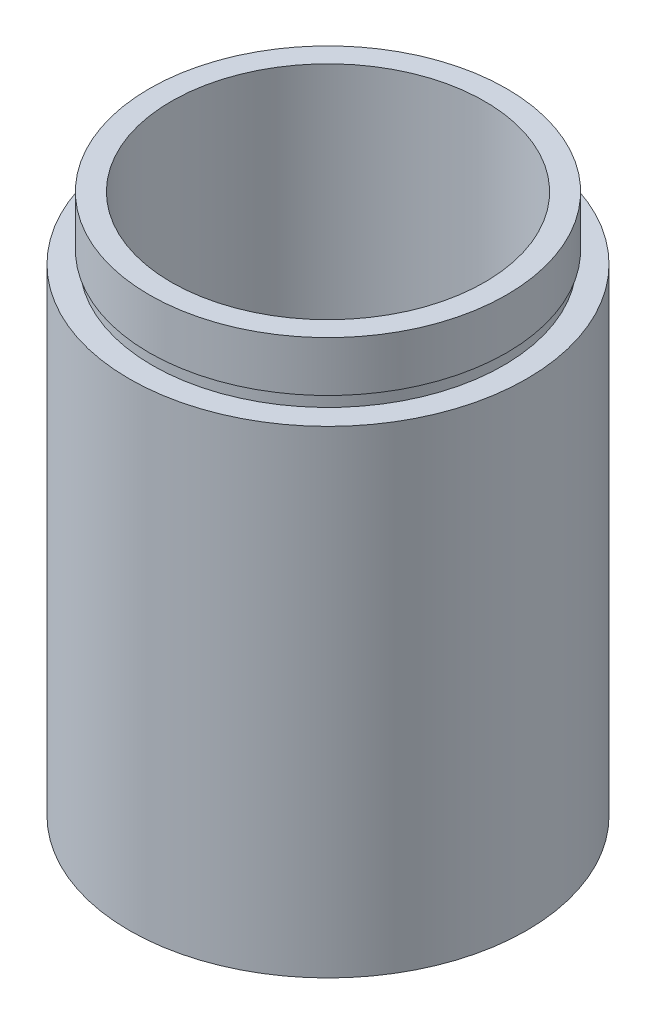
ISO-10303-21;
HEADER;
FILE_DESCRIPTION(('STEP AP214'),'2;1');
FILE_NAME('part.step','',(''),(''),'','','');
FILE_SCHEMA(('AUTOMOTIVE_DESIGN { 1 0 10303 214 1 1 1 1 }'));
ENDSEC;
DATA;
#1=APPLICATION_CONTEXT('core data for automotive mechanical design processes');
#2=APPLICATION_PROTOCOL_DEFINITION('international standard','automotive_design',2000,#1);
#3=PRODUCT_CONTEXT('',#1,'mechanical');
#4=PRODUCT('Part','Part','',(#3));
#5=PRODUCT_RELATED_PRODUCT_CATEGORY('part','',(#4));
#6=PRODUCT_DEFINITION_FORMATION('','',#4);
#7=PRODUCT_DEFINITION_CONTEXT('part definition',#1,'design');
#8=PRODUCT_DEFINITION('design','',#6,#7);
#9=PRODUCT_DEFINITION_SHAPE('','',#8);
#10=(LENGTH_UNIT() NAMED_UNIT(*) SI_UNIT(.MILLI.,.METRE.));
#11=(NAMED_UNIT(*) PLANE_ANGLE_UNIT() SI_UNIT($,.RADIAN.));
#12=(NAMED_UNIT(*) SI_UNIT($,.STERADIAN.) SOLID_ANGLE_UNIT());
#13=UNCERTAINTY_MEASURE_WITH_UNIT(LENGTH_MEASURE(1.E-05),#10,'distance_accuracy_value','');
#14=(GEOMETRIC_REPRESENTATION_CONTEXT(3) GLOBAL_UNCERTAINTY_ASSIGNED_CONTEXT((#13)) GLOBAL_UNIT_ASSIGNED_CONTEXT((#10,
#11,#12)) REPRESENTATION_CONTEXT('',''));
#15=CARTESIAN_POINT('',(0.,0.,0.));
#16=DIRECTION('',(0.,0.,1.));
#17=DIRECTION('',(1.,0.,0.));
#18=AXIS2_PLACEMENT_3D('',#15,#16,#17);
#19=CARTESIAN_POINT('',(14.25,0.,0.));
#20=DIRECTION('',(0.,1.,0.));
#21=DIRECTION('',(0.,0.,1.));
#22=AXIS2_PLACEMENT_3D('',#19,#20,#21);
#23=PLANE('',#22);
#24=CARTESIAN_POINT('',(0.,0.,0.));
#25=DIRECTION('',(0.,1.,0.));
#26=DIRECTION('',(0.,0.,1.));
#27=AXIS2_PLACEMENT_3D('',#24,#25,#26);
#28=CIRCLE('',#27,15.85);
#29=CARTESIAN_POINT('',(0.,0.,15.85));
#30=VERTEX_POINT('',#29);
#31=EDGE_CURVE('E10',#30,#30,#28,.T.);
#32=ORIENTED_EDGE('',*,*,#31,.F.);
#33=EDGE_LOOP('',(#32));
#34=FACE_BOUND('',#33,.T.);
#35=CARTESIAN_POINT('',(0.,0.,0.));
#36=DIRECTION('',(0.,1.,0.));
#37=DIRECTION('',(0.,0.,1.));
#38=AXIS2_PLACEMENT_3D('',#35,#36,#37);
#39=CIRCLE('',#38,14.25);
#40=CARTESIAN_POINT('',(0.,0.,14.25));
#41=VERTEX_POINT('',#40);
#42=EDGE_CURVE('E75',#41,#41,#39,.T.);
#43=ORIENTED_EDGE('',*,*,#42,.T.);
#44=EDGE_LOOP('',(#43));
#45=FACE_BOUND('',#44,.T.);
#46=ADVANCED_FACE('F35',(#34,#45),#23,.F.);
#47=CARTESIAN_POINT('',(0.,161.376166943427,0.));
#48=DIRECTION('',(0.,1.,0.));
#49=DIRECTION('',(0.,0.,1.));
#50=AXIS2_PLACEMENT_3D('',#47,#48,#49);
#51=CYLINDRICAL_SURFACE('',#50,15.85);
#52=CARTESIAN_POINT('',(0.,38.1,0.));
#53=DIRECTION('',(0.,1.,0.));
#54=DIRECTION('',(0.,0.,1.));
#55=AXIS2_PLACEMENT_3D('',#52,#53,#54);
#56=CIRCLE('',#55,15.85);
#57=CARTESIAN_POINT('',(0.,38.1,15.85));
#58=VERTEX_POINT('',#57);
#59=EDGE_CURVE('E41',#58,#58,#56,.T.);
#60=ORIENTED_EDGE('',*,*,#59,.F.);
#61=EDGE_LOOP('',(#60));
#62=FACE_BOUND('',#61,.T.);
#63=ORIENTED_EDGE('',*,*,#31,.T.);
#64=EDGE_LOOP('',(#63));
#65=FACE_BOUND('',#64,.T.);
#66=ADVANCED_FACE('F136',(#62,#65),#51,.T.);
#67=CARTESIAN_POINT('',(14.,38.1,0.));
#68=DIRECTION('',(0.,-1.,0.));
#69=DIRECTION('',(0.,0.,-1.));
#70=AXIS2_PLACEMENT_3D('',#67,#68,#69);
#71=PLANE('',#70);
#72=CARTESIAN_POINT('',(0.,38.1,0.));
#73=DIRECTION('',(0.,1.,0.));
#74=DIRECTION('',(0.,0.,1.));
#75=AXIS2_PLACEMENT_3D('',#72,#73,#74);
#76=CIRCLE('',#75,14.);
#77=CARTESIAN_POINT('',(0.,38.1,14.));
#78=VERTEX_POINT('',#77);
#79=EDGE_CURVE('E45',#78,#78,#76,.T.);
#80=ORIENTED_EDGE('',*,*,#79,.F.);
#81=EDGE_LOOP('',(#80));
#82=FACE_BOUND('',#81,.T.);
#83=ORIENTED_EDGE('',*,*,#59,.T.);
#84=EDGE_LOOP('',(#83));
#85=FACE_BOUND('',#84,.T.);
#86=ADVANCED_FACE('F131',(#82,#85),#71,.F.);
#87=CARTESIAN_POINT('',(0.,161.376166943427,0.));
#88=DIRECTION('',(0.,1.,0.));
#89=DIRECTION('',(0.,0.,1.));
#90=AXIS2_PLACEMENT_3D('',#87,#88,#89);
#91=CYLINDRICAL_SURFACE('',#90,14.);
#92=CARTESIAN_POINT('',(0.,39.1,0.));
#93=DIRECTION('',(0.,1.,0.));
#94=DIRECTION('',(0.,0.,1.));
#95=AXIS2_PLACEMENT_3D('',#92,#93,#94);
#96=CIRCLE('',#95,14.);
#97=CARTESIAN_POINT('',(0.,39.1,14.));
#98=VERTEX_POINT('',#97);
#99=EDGE_CURVE('E49',#98,#98,#96,.T.);
#100=ORIENTED_EDGE('',*,*,#99,.F.);
#101=EDGE_LOOP('',(#100));
#102=FACE_BOUND('',#101,.T.);
#103=ORIENTED_EDGE('',*,*,#79,.T.);
#104=EDGE_LOOP('',(#103));
#105=FACE_BOUND('',#104,.T.);
#106=ADVANCED_FACE('F125',(#102,#105),#91,.T.);
#107=CARTESIAN_POINT('',(14.,39.1,0.));
#108=DIRECTION('',(0.,1.,0.));
#109=DIRECTION('',(0.,0.,1.));
#110=AXIS2_PLACEMENT_3D('',#107,#108,#109);
#111=PLANE('',#110);
#112=CARTESIAN_POINT('',(0.,39.1,0.));
#113=DIRECTION('',(0.,1.,0.));
#114=DIRECTION('',(0.,0.,1.));
#115=AXIS2_PLACEMENT_3D('',#112,#113,#114);
#116=CIRCLE('',#115,14.25);
#117=CARTESIAN_POINT('',(0.,39.1,14.25));
#118=VERTEX_POINT('',#117);
#119=EDGE_CURVE('E54',#118,#118,#116,.T.);
#120=ORIENTED_EDGE('',*,*,#119,.F.);
#121=EDGE_LOOP('',(#120));
#122=FACE_BOUND('',#121,.T.);
#123=ORIENTED_EDGE('',*,*,#99,.T.);
#124=EDGE_LOOP('',(#123));
#125=FACE_BOUND('',#124,.T.);
#126=ADVANCED_FACE('F119',(#122,#125),#111,.F.);
#127=CARTESIAN_POINT('',(0.,161.376166943427,0.));
#128=DIRECTION('',(0.,1.,0.));
#129=DIRECTION('',(0.,0.,1.));
#130=AXIS2_PLACEMENT_3D('',#127,#128,#129);
#131=CYLINDRICAL_SURFACE('',#130,14.25);
#132=CARTESIAN_POINT('',(0.,43.1,0.));
#133=DIRECTION('',(0.,1.,0.));
#134=DIRECTION('',(0.,0.,1.));
#135=AXIS2_PLACEMENT_3D('',#132,#133,#134);
#136=CIRCLE('',#135,14.25);
#137=CARTESIAN_POINT('',(0.,43.1,14.25));
#138=VERTEX_POINT('',#137);
#139=EDGE_CURVE('E57',#138,#138,#136,.T.);
#140=ORIENTED_EDGE('',*,*,#139,.F.);
#141=EDGE_LOOP('',(#140));
#142=FACE_BOUND('',#141,.T.);
#143=ORIENTED_EDGE('',*,*,#119,.T.);
#144=EDGE_LOOP('',(#143));
#145=FACE_BOUND('',#144,.T.);
#146=ADVANCED_FACE('F113',(#142,#145),#131,.T.);
#147=CARTESIAN_POINT('',(12.5,43.1,0.));
#148=DIRECTION('',(0.,-1.,0.));
#149=DIRECTION('',(0.,0.,-1.));
#150=AXIS2_PLACEMENT_3D('',#147,#148,#149);
#151=PLANE('',#150);
#152=CARTESIAN_POINT('',(0.,43.1,0.));
#153=DIRECTION('',(0.,1.,0.));
#154=DIRECTION('',(0.,0.,1.));
#155=AXIS2_PLACEMENT_3D('',#152,#153,#154);
#156=CIRCLE('',#155,12.5);
#157=CARTESIAN_POINT('',(0.,43.1,12.5));
#158=VERTEX_POINT('',#157);
#159=EDGE_CURVE('E60',#158,#158,#156,.T.);
#160=ORIENTED_EDGE('',*,*,#159,.F.);
#161=EDGE_LOOP('',(#160));
#162=FACE_BOUND('',#161,.T.);
#163=ORIENTED_EDGE('',*,*,#139,.T.);
#164=EDGE_LOOP('',(#163));
#165=FACE_BOUND('',#164,.T.);
#166=ADVANCED_FACE('F107',(#162,#165),#151,.F.);
#167=CARTESIAN_POINT('',(0.,161.376166943427,0.));
#168=DIRECTION('',(0.,1.,0.));
#169=DIRECTION('',(0.,0.,1.));
#170=AXIS2_PLACEMENT_3D('',#167,#168,#169);
#171=CYLINDRICAL_SURFACE('',#170,12.5);
#172=CARTESIAN_POINT('',(0.,5.49999999999998,0.));
#173=DIRECTION('',(0.,1.,0.));
#174=DIRECTION('',(0.,0.,1.));
#175=AXIS2_PLACEMENT_3D('',#172,#173,#174);
#176=CIRCLE('',#175,12.5);
#177=CARTESIAN_POINT('',(0.,5.49999999999998,12.5));
#178=VERTEX_POINT('',#177);
#179=EDGE_CURVE('E63',#178,#178,#176,.T.);
#180=ORIENTED_EDGE('',*,*,#179,.F.);
#181=EDGE_LOOP('',(#180));
#182=FACE_BOUND('',#181,.T.);
#183=ORIENTED_EDGE('',*,*,#159,.T.);
#184=EDGE_LOOP('',(#183));
#185=FACE_BOUND('',#184,.T.);
#186=ADVANCED_FACE('F101',(#182,#185),#171,.F.);
#187=CARTESIAN_POINT('',(12.5,5.49999999999998,0.));
#188=DIRECTION('',(0.,1.,0.));
#189=DIRECTION('',(0.,0.,1.));
#190=AXIS2_PLACEMENT_3D('',#187,#188,#189);
#191=PLANE('',#190);
#192=CARTESIAN_POINT('',(0.,5.49999999999998,0.));
#193=DIRECTION('',(0.,1.,0.));
#194=DIRECTION('',(0.,0.,1.));
#195=AXIS2_PLACEMENT_3D('',#192,#193,#194);
#196=CIRCLE('',#195,14.35);
#197=CARTESIAN_POINT('',(0.,5.49999999999998,14.35));
#198=VERTEX_POINT('',#197);
#199=EDGE_CURVE('E66',#198,#198,#196,.T.);
#200=ORIENTED_EDGE('',*,*,#199,.F.);
#201=EDGE_LOOP('',(#200));
#202=FACE_BOUND('',#201,.T.);
#203=ORIENTED_EDGE('',*,*,#179,.T.);
#204=EDGE_LOOP('',(#203));
#205=FACE_BOUND('',#204,.T.);
#206=ADVANCED_FACE('F95',(#202,#205),#191,.F.);
#207=CARTESIAN_POINT('',(0.,161.376166943427,0.));
#208=DIRECTION('',(0.,1.,0.));
#209=DIRECTION('',(0.,0.,1.));
#210=AXIS2_PLACEMENT_3D('',#207,#208,#209);
#211=CYLINDRICAL_SURFACE('',#210,14.35);
#212=CARTESIAN_POINT('',(0.,4.49999999999998,0.));
#213=DIRECTION('',(0.,1.,0.));
#214=DIRECTION('',(0.,0.,1.));
#215=AXIS2_PLACEMENT_3D('',#212,#213,#214);
#216=CIRCLE('',#215,14.35);
#217=CARTESIAN_POINT('',(0.,4.49999999999998,14.35));
#218=VERTEX_POINT('',#217);
#219=EDGE_CURVE('E69',#218,#218,#216,.T.);
#220=ORIENTED_EDGE('',*,*,#219,.F.);
#221=EDGE_LOOP('',(#220));
#222=FACE_BOUND('',#221,.T.);
#223=ORIENTED_EDGE('',*,*,#199,.T.);
#224=EDGE_LOOP('',(#223));
#225=FACE_BOUND('',#224,.T.);
#226=ADVANCED_FACE('F89',(#222,#225),#211,.F.);
#227=CARTESIAN_POINT('',(14.25,4.50000000000001,0.));
#228=DIRECTION('',(0.,-1.,0.));
#229=DIRECTION('',(0.,0.,-1.));
#230=AXIS2_PLACEMENT_3D('',#227,#228,#229);
#231=PLANE('',#230);
#232=CARTESIAN_POINT('',(0.,4.50000000000003,0.));
#233=DIRECTION('',(0.,1.,0.));
#234=DIRECTION('',(0.,0.,1.));
#235=AXIS2_PLACEMENT_3D('',#232,#233,#234);
#236=CIRCLE('',#235,14.25);
#237=CARTESIAN_POINT('',(0.,4.50000000000003,14.25));
#238=VERTEX_POINT('',#237);
#239=EDGE_CURVE('E72',#238,#238,#236,.T.);
#240=ORIENTED_EDGE('',*,*,#239,.F.);
#241=EDGE_LOOP('',(#240));
#242=FACE_BOUND('',#241,.T.);
#243=ORIENTED_EDGE('',*,*,#219,.T.);
#244=EDGE_LOOP('',(#243));
#245=FACE_BOUND('',#244,.T.);
#246=ADVANCED_FACE('F83',(#242,#245),#231,.F.);
#247=CARTESIAN_POINT('',(0.,161.376166943427,0.));
#248=DIRECTION('',(0.,1.,0.));
#249=DIRECTION('',(0.,0.,1.));
#250=AXIS2_PLACEMENT_3D('',#247,#248,#249);
#251=CYLINDRICAL_SURFACE('',#250,14.25);
#252=ORIENTED_EDGE('',*,*,#42,.F.);
#253=EDGE_LOOP('',(#252));
#254=FACE_BOUND('',#253,.T.);
#255=ORIENTED_EDGE('',*,*,#239,.T.);
#256=EDGE_LOOP('',(#255));
#257=FACE_BOUND('',#256,.T.);
#258=ADVANCED_FACE('F80',(#254,#257),#251,.F.);
#259=CLOSED_SHELL('',(#46,#66,#86,#106,#126,#146,#166,#186,#206,#226,#246,#258));
#260=MANIFOLD_SOLID_BREP('B2',#259);
#261=ADVANCED_BREP_SHAPE_REPRESENTATION('',(#18,#260),#14);
#262=SHAPE_DEFINITION_REPRESENTATION(#9,#261);
ENDSEC;
END-ISO-10303-21;
